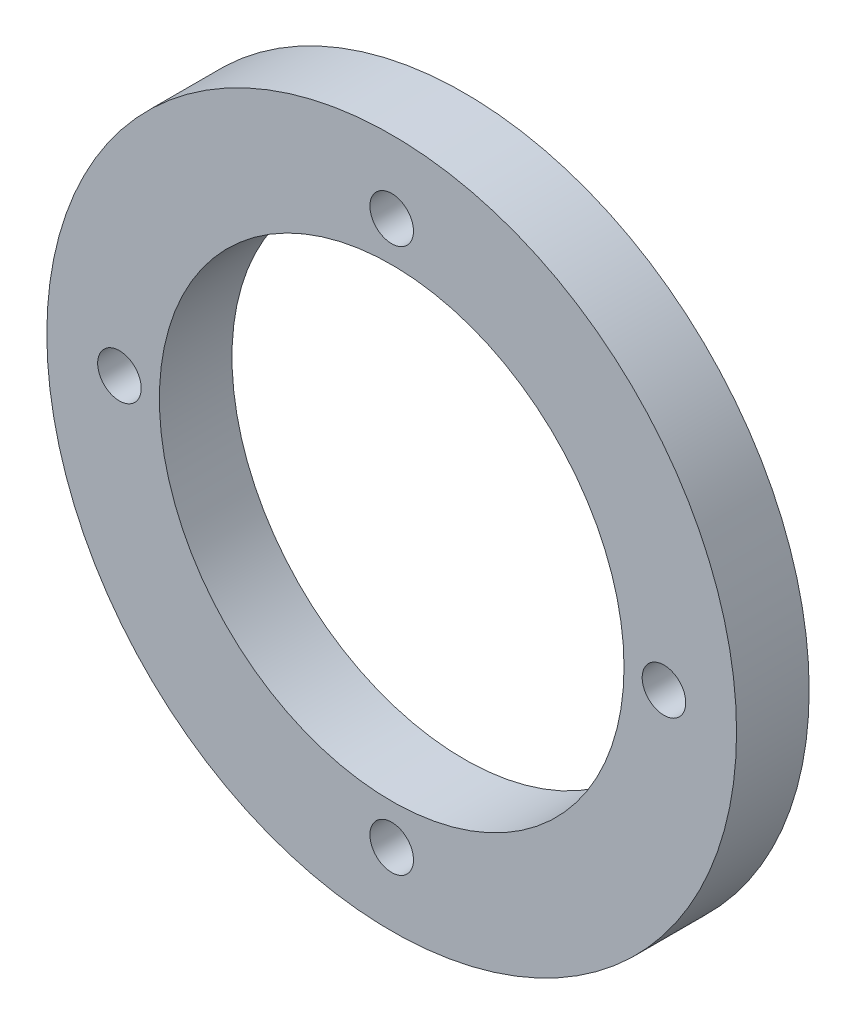
ISO-10303-21;
HEADER;
FILE_DESCRIPTION(('STEP AP214'),'2;1');
FILE_NAME('part.step','',(''),(''),'','','');
FILE_SCHEMA(('AUTOMOTIVE_DESIGN { 1 0 10303 214 1 1 1 1 }'));
ENDSEC;
DATA;
#1=APPLICATION_CONTEXT('core data for automotive mechanical design processes');
#2=APPLICATION_PROTOCOL_DEFINITION('international standard','automotive_design',2000,#1);
#3=PRODUCT_CONTEXT('',#1,'mechanical');
#4=PRODUCT('Part','Part','',(#3));
#5=PRODUCT_RELATED_PRODUCT_CATEGORY('part','',(#4));
#6=PRODUCT_DEFINITION_FORMATION('','',#4);
#7=PRODUCT_DEFINITION_CONTEXT('part definition',#1,'design');
#8=PRODUCT_DEFINITION('design','',#6,#7);
#9=PRODUCT_DEFINITION_SHAPE('','',#8);
#10=(LENGTH_UNIT() NAMED_UNIT(*) SI_UNIT(.MILLI.,.METRE.));
#11=(NAMED_UNIT(*) PLANE_ANGLE_UNIT() SI_UNIT($,.RADIAN.));
#12=(NAMED_UNIT(*) SI_UNIT($,.STERADIAN.) SOLID_ANGLE_UNIT());
#13=UNCERTAINTY_MEASURE_WITH_UNIT(LENGTH_MEASURE(1.E-05),#10,'distance_accuracy_value','');
#14=(GEOMETRIC_REPRESENTATION_CONTEXT(3) GLOBAL_UNCERTAINTY_ASSIGNED_CONTEXT((#13)) GLOBAL_UNIT_ASSIGNED_CONTEXT((#10,
#11,#12)) REPRESENTATION_CONTEXT('',''));
#15=CARTESIAN_POINT('',(0.,0.,0.));
#16=DIRECTION('',(0.,0.,1.));
#17=DIRECTION('',(1.,0.,0.));
#18=AXIS2_PLACEMENT_3D('',#15,#16,#17);
#19=CARTESIAN_POINT('',(0.,0.,1.));
#20=DIRECTION('',(0.,0.,-1.));
#21=DIRECTION('',(-1.,0.,0.));
#22=AXIS2_PLACEMENT_3D('',#19,#20,#21);
#23=CYLINDRICAL_SURFACE('',#22,3.2);
#24=CARTESIAN_POINT('',(0.,0.,1.));
#25=DIRECTION('',(0.,0.,1.));
#26=DIRECTION('',(1.,0.,0.));
#27=AXIS2_PLACEMENT_3D('',#24,#25,#26);
#28=CIRCLE('',#27,3.2);
#29=CARTESIAN_POINT('',(3.2,0.,1.));
#30=VERTEX_POINT('',#29);
#31=EDGE_CURVE('E41',#30,#30,#28,.T.);
#32=ORIENTED_EDGE('',*,*,#31,.T.);
#33=EDGE_LOOP('',(#32));
#34=FACE_BOUND('',#33,.T.);
#35=CARTESIAN_POINT('',(0.,0.,0.));
#36=DIRECTION('',(0.,0.,1.));
#37=DIRECTION('',(1.,0.,0.));
#38=AXIS2_PLACEMENT_3D('',#35,#36,#37);
#39=CIRCLE('',#38,3.2);
#40=CARTESIAN_POINT('',(3.2,0.,0.));
#41=VERTEX_POINT('',#40);
#42=EDGE_CURVE('E61',#41,#41,#39,.T.);
#43=ORIENTED_EDGE('',*,*,#42,.F.);
#44=EDGE_LOOP('',(#43));
#45=FACE_BOUND('',#44,.T.);
#46=ADVANCED_FACE('F33',(#34,#45),#23,.F.);
#47=CARTESIAN_POINT('',(3.75000000000011,1.06122167814335E-13,1.));
#48=DIRECTION('',(0.,0.,-1.));
#49=DIRECTION('',(-1.,0.,0.));
#50=AXIS2_PLACEMENT_3D('',#47,#48,#49);
#51=CYLINDRICAL_SURFACE('',#50,0.300000000000083);
#52=CARTESIAN_POINT('',(3.75000000000011,1.06122167814335E-13,1.));
#53=DIRECTION('',(0.,0.,1.));
#54=DIRECTION('',(1.,0.,0.));
#55=AXIS2_PLACEMENT_3D('',#52,#53,#54);
#56=CIRCLE('',#55,0.300000000000083);
#57=CARTESIAN_POINT('',(4.05000000000019,1.06122167814335E-13,1.));
#58=VERTEX_POINT('',#57);
#59=EDGE_CURVE('E46',#58,#58,#56,.T.);
#60=ORIENTED_EDGE('',*,*,#59,.T.);
#61=EDGE_LOOP('',(#60));
#62=FACE_BOUND('',#61,.T.);
#63=CARTESIAN_POINT('',(3.75000000000011,1.06122167814335E-13,0.));
#64=DIRECTION('',(0.,0.,1.));
#65=DIRECTION('',(1.,0.,0.));
#66=AXIS2_PLACEMENT_3D('',#63,#64,#65);
#67=CIRCLE('',#66,0.300000000000083);
#68=CARTESIAN_POINT('',(4.05000000000019,1.06122167814335E-13,0.));
#69=VERTEX_POINT('',#68);
#70=EDGE_CURVE('E59',#69,#69,#67,.T.);
#71=ORIENTED_EDGE('',*,*,#70,.F.);
#72=EDGE_LOOP('',(#71));
#73=FACE_BOUND('',#72,.T.);
#74=ADVANCED_FACE('F82',(#62,#73),#51,.F.);
#75=CARTESIAN_POINT('',(2.1224433562867E-13,-3.75,1.));
#76=DIRECTION('',(0.,0.,-1.));
#77=DIRECTION('',(-1.,0.,0.));
#78=AXIS2_PLACEMENT_3D('',#75,#76,#77);
#79=CYLINDRICAL_SURFACE('',#78,0.300000000000228);
#80=CARTESIAN_POINT('',(2.1224433562867E-13,-3.75,1.));
#81=DIRECTION('',(0.,0.,1.));
#82=DIRECTION('',(1.,0.,0.));
#83=AXIS2_PLACEMENT_3D('',#80,#81,#82);
#84=CIRCLE('',#83,0.300000000000228);
#85=CARTESIAN_POINT('',(0.30000000000044,-3.75,1.));
#86=VERTEX_POINT('',#85);
#87=EDGE_CURVE('E75',#86,#86,#84,.T.);
#88=ORIENTED_EDGE('',*,*,#87,.T.);
#89=EDGE_LOOP('',(#88));
#90=FACE_BOUND('',#89,.T.);
#91=CARTESIAN_POINT('',(2.1224433562867E-13,-3.75,0.));
#92=DIRECTION('',(0.,0.,1.));
#93=DIRECTION('',(1.,0.,0.));
#94=AXIS2_PLACEMENT_3D('',#91,#92,#93);
#95=CIRCLE('',#94,0.300000000000228);
#96=CARTESIAN_POINT('',(0.30000000000044,-3.75,0.));
#97=VERTEX_POINT('',#96);
#98=EDGE_CURVE('E56',#97,#97,#95,.T.);
#99=ORIENTED_EDGE('',*,*,#98,.F.);
#100=EDGE_LOOP('',(#99));
#101=FACE_BOUND('',#100,.T.);
#102=ADVANCED_FACE('F100',(#90,#101),#79,.F.);
#103=CARTESIAN_POINT('',(-3.74999999999989,-1.06581410364015E-13,1.));
#104=DIRECTION('',(0.,0.,-1.));
#105=DIRECTION('',(-1.,0.,0.));
#106=AXIS2_PLACEMENT_3D('',#103,#104,#105);
#107=CYLINDRICAL_SURFACE('',#106,0.30000000000017);
#108=CARTESIAN_POINT('',(-3.74999999999989,-1.06581410364015E-13,1.));
#109=DIRECTION('',(0.,0.,1.));
#110=DIRECTION('',(1.,0.,0.));
#111=AXIS2_PLACEMENT_3D('',#108,#109,#110);
#112=CIRCLE('',#111,0.30000000000017);
#113=CARTESIAN_POINT('',(-3.44999999999972,-1.06581410364015E-13,1.));
#114=VERTEX_POINT('',#113);
#115=EDGE_CURVE('E70',#114,#114,#112,.T.);
#116=ORIENTED_EDGE('',*,*,#115,.T.);
#117=EDGE_LOOP('',(#116));
#118=FACE_BOUND('',#117,.T.);
#119=CARTESIAN_POINT('',(-3.74999999999989,-1.06581410364015E-13,0.));
#120=DIRECTION('',(0.,0.,1.));
#121=DIRECTION('',(1.,0.,0.));
#122=AXIS2_PLACEMENT_3D('',#119,#120,#121);
#123=CIRCLE('',#122,0.30000000000017);
#124=CARTESIAN_POINT('',(-3.44999999999972,-1.06581410364015E-13,0.));
#125=VERTEX_POINT('',#124);
#126=EDGE_CURVE('E53',#125,#125,#123,.T.);
#127=ORIENTED_EDGE('',*,*,#126,.F.);
#128=EDGE_LOOP('',(#127));
#129=FACE_BOUND('',#128,.T.);
#130=ADVANCED_FACE('F106',(#118,#129),#107,.F.);
#131=CARTESIAN_POINT('',(0.,3.75,1.));
#132=DIRECTION('',(0.,0.,-1.));
#133=DIRECTION('',(-1.,0.,0.));
#134=AXIS2_PLACEMENT_3D('',#131,#132,#133);
#135=CYLINDRICAL_SURFACE('',#134,0.3);
#136=CARTESIAN_POINT('',(0.,3.75,1.));
#137=DIRECTION('',(0.,0.,1.));
#138=DIRECTION('',(1.,0.,0.));
#139=AXIS2_PLACEMENT_3D('',#136,#137,#138);
#140=CIRCLE('',#139,0.3);
#141=CARTESIAN_POINT('',(0.3,3.75,1.));
#142=VERTEX_POINT('',#141);
#143=EDGE_CURVE('E66',#142,#142,#140,.T.);
#144=ORIENTED_EDGE('',*,*,#143,.T.);
#145=EDGE_LOOP('',(#144));
#146=FACE_BOUND('',#145,.T.);
#147=CARTESIAN_POINT('',(0.,3.75,0.));
#148=DIRECTION('',(0.,0.,1.));
#149=DIRECTION('',(1.,0.,0.));
#150=AXIS2_PLACEMENT_3D('',#147,#148,#149);
#151=CIRCLE('',#150,0.3);
#152=CARTESIAN_POINT('',(0.3,3.75,0.));
#153=VERTEX_POINT('',#152);
#154=EDGE_CURVE('E50',#153,#153,#151,.T.);
#155=ORIENTED_EDGE('',*,*,#154,.F.);
#156=EDGE_LOOP('',(#155));
#157=FACE_BOUND('',#156,.T.);
#158=ADVANCED_FACE('F35',(#146,#157),#135,.F.);
#159=CARTESIAN_POINT('',(0.,0.,1.));
#160=DIRECTION('',(0.,0.,-1.));
#161=DIRECTION('',(-1.,0.,0.));
#162=AXIS2_PLACEMENT_3D('',#159,#160,#161);
#163=CYLINDRICAL_SURFACE('',#162,4.75);
#164=CARTESIAN_POINT('',(0.,0.,1.));
#165=DIRECTION('',(0.,0.,1.));
#166=DIRECTION('',(1.,0.,0.));
#167=AXIS2_PLACEMENT_3D('',#164,#165,#166);
#168=CIRCLE('',#167,4.75);
#169=CARTESIAN_POINT('',(4.75,0.,1.));
#170=VERTEX_POINT('',#169);
#171=EDGE_CURVE('E10',#170,#170,#168,.T.);
#172=ORIENTED_EDGE('',*,*,#171,.F.);
#173=EDGE_LOOP('',(#172));
#174=FACE_BOUND('',#173,.T.);
#175=CARTESIAN_POINT('',(0.,0.,0.));
#176=DIRECTION('',(0.,0.,1.));
#177=DIRECTION('',(1.,0.,0.));
#178=AXIS2_PLACEMENT_3D('',#175,#176,#177);
#179=CIRCLE('',#178,4.75);
#180=CARTESIAN_POINT('',(4.75,0.,0.));
#181=VERTEX_POINT('',#180);
#182=EDGE_CURVE('E37',#181,#181,#179,.T.);
#183=ORIENTED_EDGE('',*,*,#182,.T.);
#184=EDGE_LOOP('',(#183));
#185=FACE_BOUND('',#184,.T.);
#186=ADVANCED_FACE('F89',(#174,#185),#163,.T.);
#187=CARTESIAN_POINT('',(0.,0.,1.));
#188=DIRECTION('',(0.,0.,1.));
#189=DIRECTION('',(1.,0.,0.));
#190=AXIS2_PLACEMENT_3D('',#187,#188,#189);
#191=PLANE('',#190);
#192=ORIENTED_EDGE('',*,*,#143,.F.);
#193=EDGE_LOOP('',(#192));
#194=FACE_BOUND('',#193,.T.);
#195=ORIENTED_EDGE('',*,*,#115,.F.);
#196=EDGE_LOOP('',(#195));
#197=FACE_BOUND('',#196,.T.);
#198=ORIENTED_EDGE('',*,*,#87,.F.);
#199=EDGE_LOOP('',(#198));
#200=FACE_BOUND('',#199,.T.);
#201=ORIENTED_EDGE('',*,*,#59,.F.);
#202=EDGE_LOOP('',(#201));
#203=FACE_BOUND('',#202,.T.);
#204=ORIENTED_EDGE('',*,*,#31,.F.);
#205=EDGE_LOOP('',(#204));
#206=FACE_BOUND('',#205,.T.);
#207=ORIENTED_EDGE('',*,*,#171,.T.);
#208=EDGE_LOOP('',(#207));
#209=FACE_BOUND('',#208,.T.);
#210=ADVANCED_FACE('F85',(#194,#197,#200,#203,#206,#209),#191,.T.);
#211=CARTESIAN_POINT('',(0.,0.,0.));
#212=DIRECTION('',(0.,0.,1.));
#213=DIRECTION('',(1.,0.,0.));
#214=AXIS2_PLACEMENT_3D('',#211,#212,#213);
#215=PLANE('',#214);
#216=ORIENTED_EDGE('',*,*,#154,.T.);
#217=EDGE_LOOP('',(#216));
#218=FACE_BOUND('',#217,.T.);
#219=ORIENTED_EDGE('',*,*,#126,.T.);
#220=EDGE_LOOP('',(#219));
#221=FACE_BOUND('',#220,.T.);
#222=ORIENTED_EDGE('',*,*,#98,.T.);
#223=EDGE_LOOP('',(#222));
#224=FACE_BOUND('',#223,.T.);
#225=ORIENTED_EDGE('',*,*,#70,.T.);
#226=EDGE_LOOP('',(#225));
#227=FACE_BOUND('',#226,.T.);
#228=ORIENTED_EDGE('',*,*,#42,.T.);
#229=EDGE_LOOP('',(#228));
#230=FACE_BOUND('',#229,.T.);
#231=ORIENTED_EDGE('',*,*,#182,.F.);
#232=EDGE_LOOP('',(#231));
#233=FACE_BOUND('',#232,.T.);
#234=ADVANCED_FACE('F88',(#218,#221,#224,#227,#230,#233),#215,.F.);
#235=CLOSED_SHELL('',(#46,#74,#102,#130,#158,#186,#210,#234));
#236=MANIFOLD_SOLID_BREP('B2',#235);
#237=ADVANCED_BREP_SHAPE_REPRESENTATION('',(#18,#236),#14);
#238=SHAPE_DEFINITION_REPRESENTATION(#9,#237);
ENDSEC;
END-ISO-10303-21;
